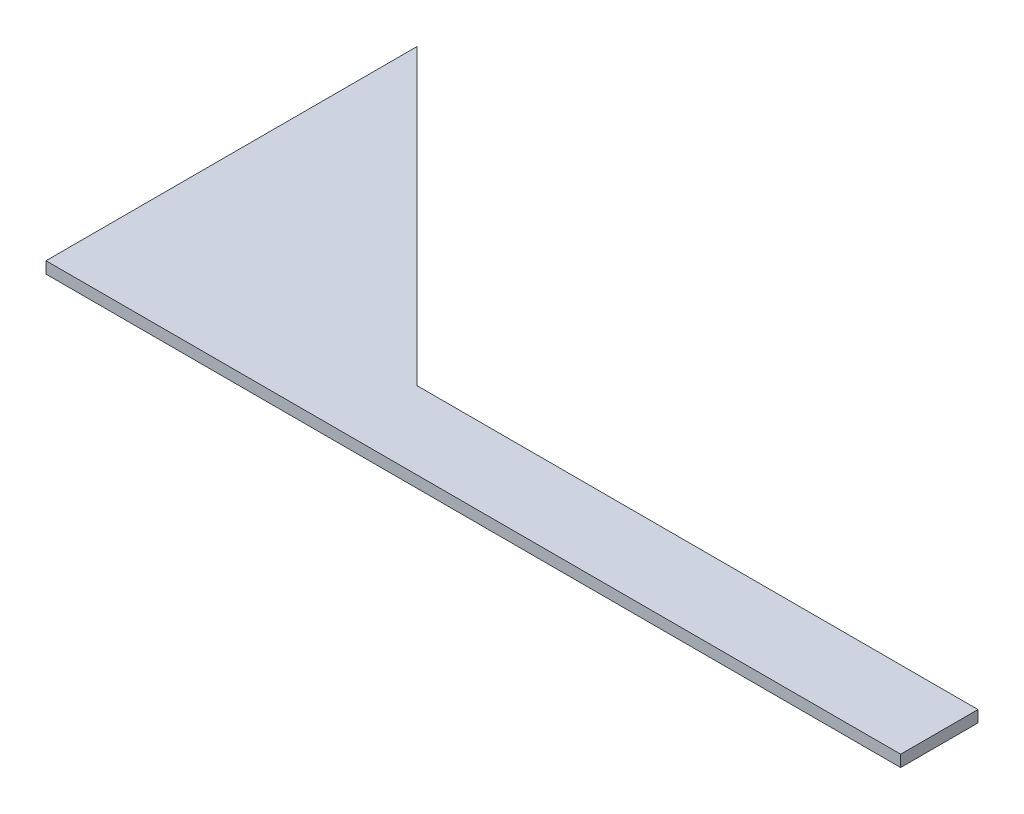
ISO-10303-21;
HEADER;
FILE_DESCRIPTION(('STEP AP214'),'2;1');
FILE_NAME('part.step','',(''),(''),'','','');
FILE_SCHEMA(('AUTOMOTIVE_DESIGN { 1 0 10303 214 1 1 1 1 }'));
ENDSEC;
DATA;
#1=APPLICATION_CONTEXT('core data for automotive mechanical design processes');
#2=APPLICATION_PROTOCOL_DEFINITION('international standard','automotive_design',2000,#1);
#3=PRODUCT_CONTEXT('',#1,'mechanical');
#4=PRODUCT('Part','Part','',(#3));
#5=PRODUCT_RELATED_PRODUCT_CATEGORY('part','',(#4));
#6=PRODUCT_DEFINITION_FORMATION('','',#4);
#7=PRODUCT_DEFINITION_CONTEXT('part definition',#1,'design');
#8=PRODUCT_DEFINITION('design','',#6,#7);
#9=PRODUCT_DEFINITION_SHAPE('','',#8);
#10=(LENGTH_UNIT() NAMED_UNIT(*) SI_UNIT(.MILLI.,.METRE.));
#11=(NAMED_UNIT(*) PLANE_ANGLE_UNIT() SI_UNIT($,.RADIAN.));
#12=(NAMED_UNIT(*) SI_UNIT($,.STERADIAN.) SOLID_ANGLE_UNIT());
#13=UNCERTAINTY_MEASURE_WITH_UNIT(LENGTH_MEASURE(1.E-05),#10,'distance_accuracy_value','');
#14=(GEOMETRIC_REPRESENTATION_CONTEXT(3) GLOBAL_UNCERTAINTY_ASSIGNED_CONTEXT((#13)) GLOBAL_UNIT_ASSIGNED_CONTEXT((#10,
#11,#12)) REPRESENTATION_CONTEXT('',''));
#15=CARTESIAN_POINT('',(0.,0.,0.));
#16=DIRECTION('',(0.,0.,1.));
#17=DIRECTION('',(1.,0.,0.));
#18=AXIS2_PLACEMENT_3D('',#15,#16,#17);
#19=CARTESIAN_POINT('',(-147.565809021337,4.7625,0.));
#20=DIRECTION('',(0.,0.,1.));
#21=DIRECTION('',(1.,0.,0.));
#22=AXIS2_PLACEMENT_3D('',#19,#20,#21);
#23=PLANE('',#22);
#24=DIRECTION('',(-1.,0.,0.));
#25=VECTOR('',#24,1.);
#26=CARTESIAN_POINT('',(-147.565809021337,0.,0.));
#27=LINE('',#26,#25);
#28=CARTESIAN_POINT('',(350.901,0.,0.));
#29=VERTEX_POINT('',#28);
#30=CARTESIAN_POINT('',(0.,0.,0.));
#31=VERTEX_POINT('',#30);
#32=EDGE_CURVE('E118',#29,#31,#27,.T.);
#33=ORIENTED_EDGE('',*,*,#32,.F.);
#34=DIRECTION('',(0.,-1.,0.));
#35=VECTOR('',#34,1.);
#36=CARTESIAN_POINT('',(350.901,4.7625,0.));
#37=LINE('',#36,#35);
#38=CARTESIAN_POINT('',(350.901,4.7625,0.));
#39=VERTEX_POINT('',#38);
#40=EDGE_CURVE('E11',#39,#29,#37,.T.);
#41=ORIENTED_EDGE('',*,*,#40,.F.);
#42=DIRECTION('',(-1.,0.,0.));
#43=VECTOR('',#42,1.);
#44=CARTESIAN_POINT('',(-147.565809021337,4.7625,0.));
#45=LINE('',#44,#43);
#46=CARTESIAN_POINT('',(0.,4.7625,0.));
#47=VERTEX_POINT('',#46);
#48=EDGE_CURVE('E132',#39,#47,#45,.T.);
#49=ORIENTED_EDGE('',*,*,#48,.T.);
#50=DIRECTION('',(0.,-1.,0.));
#51=VECTOR('',#50,1.);
#52=CARTESIAN_POINT('',(0.,4.7625,0.));
#53=LINE('',#52,#51);
#54=EDGE_CURVE('E54',#47,#31,#53,.T.);
#55=ORIENTED_EDGE('',*,*,#54,.T.);
#56=EDGE_LOOP('',(#33,#41,#49,#55));
#57=FACE_BOUND('',#56,.T.);
#58=ADVANCED_FACE('F38',(#57),#23,.T.);
#59=CARTESIAN_POINT('',(350.901,4.7625,-51.4129218305375));
#60=DIRECTION('',(1.,0.,0.));
#61=DIRECTION('',(0.,0.,-1.));
#62=AXIS2_PLACEMENT_3D('',#59,#60,#61);
#63=PLANE('',#62);
#64=DIRECTION('',(0.,0.,1.));
#65=VECTOR('',#64,1.);
#66=CARTESIAN_POINT('',(350.901,0.,-51.4129218305375));
#67=LINE('',#66,#65);
#68=CARTESIAN_POINT('',(350.901,0.,-31.75));
#69=VERTEX_POINT('',#68);
#70=EDGE_CURVE('E120',#69,#29,#67,.T.);
#71=ORIENTED_EDGE('',*,*,#70,.F.);
#72=DIRECTION('',(0.,-1.,0.));
#73=VECTOR('',#72,1.);
#74=CARTESIAN_POINT('',(350.901,4.7625,-31.75));
#75=LINE('',#74,#73);
#76=CARTESIAN_POINT('',(350.901,4.7625,-31.75));
#77=VERTEX_POINT('',#76);
#78=EDGE_CURVE('E46',#77,#69,#75,.T.);
#79=ORIENTED_EDGE('',*,*,#78,.F.);
#80=DIRECTION('',(0.,0.,1.));
#81=VECTOR('',#80,1.);
#82=CARTESIAN_POINT('',(350.901,4.7625,-51.4129218305375));
#83=LINE('',#82,#81);
#84=EDGE_CURVE('E105',#77,#39,#83,.T.);
#85=ORIENTED_EDGE('',*,*,#84,.T.);
#86=ORIENTED_EDGE('',*,*,#40,.T.);
#87=EDGE_LOOP('',(#71,#79,#85,#86));
#88=FACE_BOUND('',#87,.T.);
#89=ADVANCED_FACE('F138',(#88),#63,.T.);
#90=CARTESIAN_POINT('',(-147.565809021337,4.7625,-31.75));
#91=DIRECTION('',(0.,0.,-1.));
#92=DIRECTION('',(-1.,0.,0.));
#93=AXIS2_PLACEMENT_3D('',#90,#91,#92);
#94=PLANE('',#93);
#95=DIRECTION('',(1.,0.,0.));
#96=VECTOR('',#95,1.);
#97=CARTESIAN_POINT('',(-147.565809021337,0.,-31.75));
#98=LINE('',#97,#96);
#99=CARTESIAN_POINT('',(120.65,0.,-31.75));
#100=VERTEX_POINT('',#99);
#101=EDGE_CURVE('E93',#100,#69,#98,.T.);
#102=ORIENTED_EDGE('',*,*,#101,.F.);
#103=DIRECTION('',(0.,-1.,0.));
#104=VECTOR('',#103,1.);
#105=CARTESIAN_POINT('',(120.65,4.7625,-31.75));
#106=LINE('',#105,#104);
#107=CARTESIAN_POINT('',(120.65,4.7625,-31.75));
#108=VERTEX_POINT('',#107);
#109=EDGE_CURVE('E88',#108,#100,#106,.T.);
#110=ORIENTED_EDGE('',*,*,#109,.F.);
#111=DIRECTION('',(1.,0.,0.));
#112=VECTOR('',#111,1.);
#113=CARTESIAN_POINT('',(-147.565809021337,4.7625,-31.75));
#114=LINE('',#113,#112);
#115=EDGE_CURVE('E91',#108,#77,#114,.T.);
#116=ORIENTED_EDGE('',*,*,#115,.T.);
#117=ORIENTED_EDGE('',*,*,#78,.T.);
#118=EDGE_LOOP('',(#102,#110,#116,#117));
#119=FACE_BOUND('',#118,.T.);
#120=ADVANCED_FACE('F90',(#119),#94,.T.);
#121=CARTESIAN_POINT('',(-23.289365425937,4.7625,-175.689365425937));
#122=DIRECTION('',(0.707106781186548,0.,-0.707106781186548));
#123=DIRECTION('',(-0.707106781186548,0.,-0.707106781186548));
#124=AXIS2_PLACEMENT_3D('',#121,#122,#123);
#125=PLANE('',#124);
#126=DIRECTION('',(0.707106781186548,0.,0.707106781186548));
#127=VECTOR('',#126,1.);
#128=CARTESIAN_POINT('',(-23.289365425937,0.,-175.689365425937));
#129=LINE('',#128,#127);
#130=CARTESIAN_POINT('',(0.,0.,-152.4));
#131=VERTEX_POINT('',#130);
#132=EDGE_CURVE('E126',#131,#100,#129,.T.);
#133=ORIENTED_EDGE('',*,*,#132,.F.);
#134=DIRECTION('',(0.,-1.,0.));
#135=VECTOR('',#134,1.);
#136=CARTESIAN_POINT('',(0.,4.7625,-152.4));
#137=LINE('',#136,#135);
#138=CARTESIAN_POINT('',(0.,4.7625,-152.4));
#139=VERTEX_POINT('',#138);
#140=EDGE_CURVE('E71',#139,#131,#137,.T.);
#141=ORIENTED_EDGE('',*,*,#140,.F.);
#142=DIRECTION('',(0.707106781186548,0.,0.707106781186548));
#143=VECTOR('',#142,1.);
#144=CARTESIAN_POINT('',(-23.289365425937,4.7625,-175.689365425937));
#145=LINE('',#144,#143);
#146=EDGE_CURVE('E103',#139,#108,#145,.T.);
#147=ORIENTED_EDGE('',*,*,#146,.T.);
#148=ORIENTED_EDGE('',*,*,#109,.T.);
#149=EDGE_LOOP('',(#133,#141,#147,#148));
#150=FACE_BOUND('',#149,.T.);
#151=ADVANCED_FACE('F108',(#150),#125,.T.);
#152=CARTESIAN_POINT('',(0.,4.7625,-51.4129218305375));
#153=DIRECTION('',(-1.,0.,0.));
#154=DIRECTION('',(0.,0.,1.));
#155=AXIS2_PLACEMENT_3D('',#152,#153,#154);
#156=PLANE('',#155);
#157=DIRECTION('',(0.,0.,-1.));
#158=VECTOR('',#157,1.);
#159=CARTESIAN_POINT('',(0.,0.,-51.4129218305375));
#160=LINE('',#159,#158);
#161=EDGE_CURVE('E128',#31,#131,#160,.T.);
#162=ORIENTED_EDGE('',*,*,#161,.F.);
#163=ORIENTED_EDGE('',*,*,#54,.F.);
#164=DIRECTION('',(0.,0.,-1.));
#165=VECTOR('',#164,1.);
#166=CARTESIAN_POINT('',(0.,4.7625,-51.4129218305375));
#167=LINE('',#166,#165);
#168=EDGE_CURVE('E110',#47,#139,#167,.T.);
#169=ORIENTED_EDGE('',*,*,#168,.T.);
#170=ORIENTED_EDGE('',*,*,#140,.T.);
#171=EDGE_LOOP('',(#162,#163,#169,#170));
#172=FACE_BOUND('',#171,.T.);
#173=ADVANCED_FACE('F141',(#172),#156,.T.);
#174=CARTESIAN_POINT('',(-147.565809021337,4.7625,-51.4129218305375));
#175=DIRECTION('',(0.,1.,0.));
#176=DIRECTION('',(0.,0.,1.));
#177=AXIS2_PLACEMENT_3D('',#174,#175,#176);
#178=PLANE('',#177);
#179=ORIENTED_EDGE('',*,*,#48,.F.);
#180=ORIENTED_EDGE('',*,*,#84,.F.);
#181=ORIENTED_EDGE('',*,*,#115,.F.);
#182=ORIENTED_EDGE('',*,*,#146,.F.);
#183=ORIENTED_EDGE('',*,*,#168,.F.);
#184=EDGE_LOOP('',(#179,#180,#181,#182,#183));
#185=FACE_BOUND('',#184,.T.);
#186=ADVANCED_FACE('F101',(#185),#178,.T.);
#187=CARTESIAN_POINT('',(-147.565809021337,0.,-51.4129218305375));
#188=DIRECTION('',(0.,1.,0.));
#189=DIRECTION('',(0.,0.,1.));
#190=AXIS2_PLACEMENT_3D('',#187,#188,#189);
#191=PLANE('',#190);
#192=ORIENTED_EDGE('',*,*,#32,.T.);
#193=ORIENTED_EDGE('',*,*,#161,.T.);
#194=ORIENTED_EDGE('',*,*,#132,.T.);
#195=ORIENTED_EDGE('',*,*,#101,.T.);
#196=ORIENTED_EDGE('',*,*,#70,.T.);
#197=EDGE_LOOP('',(#192,#193,#194,#195,#196));
#198=FACE_BOUND('',#197,.T.);
#199=ADVANCED_FACE('F140',(#198),#191,.F.);
#200=CLOSED_SHELL('',(#58,#89,#120,#151,#173,#186,#199));
#201=MANIFOLD_SOLID_BREP('B2',#200);
#202=ADVANCED_BREP_SHAPE_REPRESENTATION('',(#18,#201),#14);
#203=SHAPE_DEFINITION_REPRESENTATION(#9,#202);
ENDSEC;
END-ISO-10303-21;
